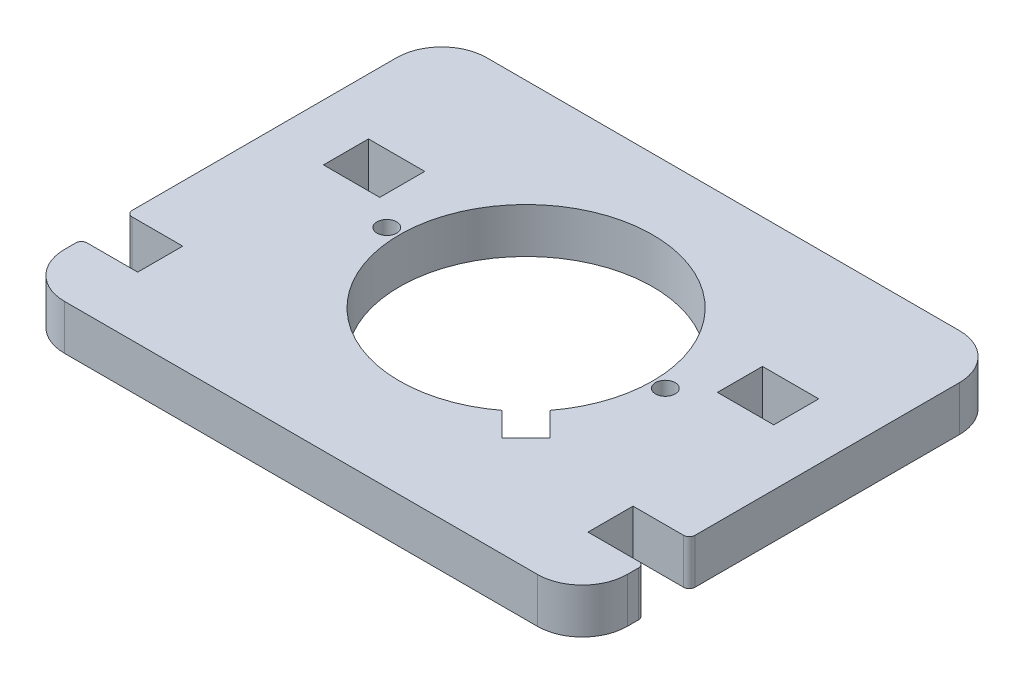
ISO-10303-21;
HEADER;
FILE_DESCRIPTION(('STEP AP214'),'2;1');
FILE_NAME('part.step','',(''),(''),'','','');
FILE_SCHEMA(('AUTOMOTIVE_DESIGN { 1 0 10303 214 1 1 1 1 }'));
ENDSEC;
DATA;
#1=APPLICATION_CONTEXT('core data for automotive mechanical design processes');
#2=APPLICATION_PROTOCOL_DEFINITION('international standard','automotive_design',2000,#1);
#3=PRODUCT_CONTEXT('',#1,'mechanical');
#4=PRODUCT('Part','Part','',(#3));
#5=PRODUCT_RELATED_PRODUCT_CATEGORY('part','',(#4));
#6=PRODUCT_DEFINITION_FORMATION('','',#4);
#7=PRODUCT_DEFINITION_CONTEXT('part definition',#1,'design');
#8=PRODUCT_DEFINITION('design','',#6,#7);
#9=PRODUCT_DEFINITION_SHAPE('','',#8);
#10=(LENGTH_UNIT() NAMED_UNIT(*) SI_UNIT(.MILLI.,.METRE.));
#11=(NAMED_UNIT(*) PLANE_ANGLE_UNIT() SI_UNIT($,.RADIAN.));
#12=(NAMED_UNIT(*) SI_UNIT($,.STERADIAN.) SOLID_ANGLE_UNIT());
#13=UNCERTAINTY_MEASURE_WITH_UNIT(LENGTH_MEASURE(1.E-05),#10,'distance_accuracy_value','');
#14=(GEOMETRIC_REPRESENTATION_CONTEXT(3) GLOBAL_UNCERTAINTY_ASSIGNED_CONTEXT((#13)) GLOBAL_UNIT_ASSIGNED_CONTEXT((#10,
#11,#12)) REPRESENTATION_CONTEXT('',''));
#15=CARTESIAN_POINT('',(0.,0.,0.));
#16=DIRECTION('',(0.,0.,1.));
#17=DIRECTION('',(1.,0.,0.));
#18=AXIS2_PLACEMENT_3D('',#15,#16,#17);
#19=CARTESIAN_POINT('',(-7.12132034355992,8.,7.12132034355984));
#20=DIRECTION('',(0.707106781186551,0.,-0.707106781186544));
#21=DIRECTION('',(-0.707106781186544,0.,-0.707106781186551));
#22=AXIS2_PLACEMENT_3D('',#19,#20,#21);
#23=PLANE('',#22);
#24=DIRECTION('',(0.707106781186544,0.,0.707106781186551));
#25=VECTOR('',#24,1.);
#26=CARTESIAN_POINT('',(-7.12132034355992,0.,7.12132034355984));
#27=LINE('',#26,#25);
#28=CARTESIAN_POINT('',(-36.3534733123383,0.,-22.1108326252188));
#29=VERTEX_POINT('',#28);
#30=CARTESIAN_POINT('',(-32.1108326252193,0.,-17.8681919380998));
#31=VERTEX_POINT('',#30);
#32=EDGE_CURVE('E363',#29,#31,#27,.T.);
#33=ORIENTED_EDGE('',*,*,#32,.F.);
#34=DIRECTION('',(0.,-1.,0.));
#35=VECTOR('',#34,1.);
#36=CARTESIAN_POINT('',(-36.3534733123383,8.,-22.1108326252188));
#37=LINE('',#36,#35);
#38=CARTESIAN_POINT('',(-36.3534733123383,8.,-22.1108326252188));
#39=VERTEX_POINT('',#38);
#40=EDGE_CURVE('E11',#39,#29,#37,.T.);
#41=ORIENTED_EDGE('',*,*,#40,.F.);
#42=DIRECTION('',(0.707106781186544,0.,0.707106781186551));
#43=VECTOR('',#42,1.);
#44=CARTESIAN_POINT('',(-7.12132034355992,8.,7.12132034355984));
#45=LINE('',#44,#43);
#46=CARTESIAN_POINT('',(-32.1108326252193,8.,-17.8681919380998));
#47=VERTEX_POINT('',#46);
#48=EDGE_CURVE('E260',#39,#47,#45,.T.);
#49=ORIENTED_EDGE('',*,*,#48,.T.);
#50=DIRECTION('',(0.,-1.,0.));
#51=VECTOR('',#50,1.);
#52=CARTESIAN_POINT('',(-32.1108326252193,8.,-17.8681919380998));
#53=LINE('',#52,#51);
#54=EDGE_CURVE('E56',#47,#31,#53,.T.);
#55=ORIENTED_EDGE('',*,*,#54,.T.);
#56=EDGE_LOOP('',(#33,#41,#49,#55));
#57=FACE_BOUND('',#56,.T.);
#58=ADVANCED_FACE('F37',(#57),#23,.T.);
#59=CARTESIAN_POINT('',(-50.,8.,-40.));
#60=DIRECTION('',(0.,-1.,0.));
#61=DIRECTION('',(0.,0.,-1.));
#62=AXIS2_PLACEMENT_3D('',#59,#60,#61);
#63=CYLINDRICAL_SURFACE('',#62,22.5);
#64=CARTESIAN_POINT('',(-50.,0.,-40.));
#65=DIRECTION('',(0.,1.,0.));
#66=DIRECTION('',(0.,0.,1.));
#67=AXIS2_PLACEMENT_3D('',#64,#65,#66);
#68=CIRCLE('',#67,22.5);
#69=CARTESIAN_POINT('',(-32.110832625219,0.,-26.3534733123381));
#70=VERTEX_POINT('',#69);
#71=EDGE_CURVE('E266',#29,#70,#68,.F.);
#72=ORIENTED_EDGE('',*,*,#71,.T.);
#73=DIRECTION('',(0.,-1.,0.));
#74=VECTOR('',#73,1.);
#75=CARTESIAN_POINT('',(-32.110832625219,8.,-26.3534733123381));
#76=LINE('',#75,#74);
#77=CARTESIAN_POINT('',(-32.110832625219,8.,-26.3534733123381));
#78=VERTEX_POINT('',#77);
#79=EDGE_CURVE('E47',#78,#70,#76,.T.);
#80=ORIENTED_EDGE('',*,*,#79,.F.);
#81=CARTESIAN_POINT('',(-50.,8.,-40.));
#82=DIRECTION('',(0.,1.,0.));
#83=DIRECTION('',(0.,0.,1.));
#84=AXIS2_PLACEMENT_3D('',#81,#82,#83);
#85=CIRCLE('',#84,22.5);
#86=EDGE_CURVE('E254',#39,#78,#85,.F.);
#87=ORIENTED_EDGE('',*,*,#86,.F.);
#88=ORIENTED_EDGE('',*,*,#40,.T.);
#89=EDGE_LOOP('',(#72,#80,#87,#88));
#90=FACE_BOUND('',#89,.T.);
#91=ADVANCED_FACE('F264',(#90),#63,.F.);
#92=CARTESIAN_POINT('',(-2.8786796564406,8.,2.87867965644057));
#93=DIRECTION('',(-0.707106781186551,0.,0.707106781186544));
#94=DIRECTION('',(0.707106781186544,0.,0.707106781186551));
#95=AXIS2_PLACEMENT_3D('',#92,#93,#94);
#96=PLANE('',#95);
#97=DIRECTION('',(-0.707106781186544,0.,-0.707106781186551));
#98=VECTOR('',#97,1.);
#99=CARTESIAN_POINT('',(-2.8786796564406,0.,2.87867965644057));
#100=LINE('',#99,#98);
#101=CARTESIAN_POINT('',(-27.8681919380997,0.,-22.1108326252188));
#102=VERTEX_POINT('',#101);
#103=EDGE_CURVE('E366',#102,#70,#100,.T.);
#104=ORIENTED_EDGE('',*,*,#103,.F.);
#105=DIRECTION('',(0.,-1.,0.));
#106=VECTOR('',#105,1.);
#107=CARTESIAN_POINT('',(-27.8681919380997,8.,-22.1108326252188));
#108=LINE('',#107,#106);
#109=CARTESIAN_POINT('',(-27.8681919380997,8.,-22.1108326252188));
#110=VERTEX_POINT('',#109);
#111=EDGE_CURVE('E153',#110,#102,#108,.T.);
#112=ORIENTED_EDGE('',*,*,#111,.F.);
#113=DIRECTION('',(-0.707106781186544,0.,-0.707106781186551));
#114=VECTOR('',#113,1.);
#115=CARTESIAN_POINT('',(-2.8786796564406,8.,2.87867965644057));
#116=LINE('',#115,#114);
#117=EDGE_CURVE('E259',#110,#78,#116,.T.);
#118=ORIENTED_EDGE('',*,*,#117,.T.);
#119=ORIENTED_EDGE('',*,*,#79,.T.);
#120=EDGE_LOOP('',(#104,#112,#118,#119));
#121=FACE_BOUND('',#120,.T.);
#122=ADVANCED_FACE('F270',(#121),#96,.T.);
#123=CARTESIAN_POINT('',(-90.,8.,0.));
#124=DIRECTION('',(1.,0.,0.));
#125=DIRECTION('',(0.,0.,-1.));
#126=AXIS2_PLACEMENT_3D('',#123,#124,#125);
#127=PLANE('',#126);
#128=DIRECTION('',(0.,0.,1.));
#129=VECTOR('',#128,1.);
#130=CARTESIAN_POINT('',(-90.,0.,0.));
#131=LINE('',#130,#129);
#132=CARTESIAN_POINT('',(-90.,0.,-52.));
#133=VERTEX_POINT('',#132);
#134=CARTESIAN_POINT('',(-90.,0.,-44.));
#135=VERTEX_POINT('',#134);
#136=EDGE_CURVE('E345',#133,#135,#131,.T.);
#137=ORIENTED_EDGE('',*,*,#136,.F.);
#138=DIRECTION('',(0.,-1.,0.));
#139=VECTOR('',#138,1.);
#140=CARTESIAN_POINT('',(-90.,8.,-52.));
#141=LINE('',#140,#139);
#142=CARTESIAN_POINT('',(-90.,8.,-52.));
#143=VERTEX_POINT('',#142);
#144=EDGE_CURVE('E373',#143,#133,#141,.T.);
#145=ORIENTED_EDGE('',*,*,#144,.F.);
#146=DIRECTION('',(0.,0.,1.));
#147=VECTOR('',#146,1.);
#148=CARTESIAN_POINT('',(-90.,8.,0.));
#149=LINE('',#148,#147);
#150=CARTESIAN_POINT('',(-90.,8.,-44.));
#151=VERTEX_POINT('',#150);
#152=EDGE_CURVE('E580',#143,#151,#149,.T.);
#153=ORIENTED_EDGE('',*,*,#152,.T.);
#154=DIRECTION('',(0.,-1.,0.));
#155=VECTOR('',#154,1.);
#156=CARTESIAN_POINT('',(-90.,8.,-44.));
#157=LINE('',#156,#155);
#158=EDGE_CURVE('E375',#151,#135,#157,.T.);
#159=ORIENTED_EDGE('',*,*,#158,.T.);
#160=EDGE_LOOP('',(#137,#145,#153,#159));
#161=FACE_BOUND('',#160,.T.);
#162=ADVANCED_FACE('F636',(#161),#127,.T.);
#163=CARTESIAN_POINT('',(0.,8.,-52.));
#164=DIRECTION('',(0.,0.,-1.));
#165=DIRECTION('',(-1.,0.,0.));
#166=AXIS2_PLACEMENT_3D('',#163,#164,#165);
#167=PLANE('',#166);
#168=DIRECTION('',(1.,0.,0.));
#169=VECTOR('',#168,1.);
#170=CARTESIAN_POINT('',(0.,0.,-52.));
#171=LINE('',#170,#169);
#172=CARTESIAN_POINT('',(-80.,0.,-52.));
#173=VERTEX_POINT('',#172);
#174=EDGE_CURVE('E348',#133,#173,#171,.T.);
#175=ORIENTED_EDGE('',*,*,#174,.T.);
#176=DIRECTION('',(0.,-1.,0.));
#177=VECTOR('',#176,1.);
#178=CARTESIAN_POINT('',(-80.,8.,-52.));
#179=LINE('',#178,#177);
#180=CARTESIAN_POINT('',(-80.,8.,-52.));
#181=VERTEX_POINT('',#180);
#182=EDGE_CURVE('E381',#181,#173,#179,.T.);
#183=ORIENTED_EDGE('',*,*,#182,.F.);
#184=DIRECTION('',(1.,0.,0.));
#185=VECTOR('',#184,1.);
#186=CARTESIAN_POINT('',(0.,8.,-52.));
#187=LINE('',#186,#185);
#188=EDGE_CURVE('E583',#143,#181,#187,.T.);
#189=ORIENTED_EDGE('',*,*,#188,.F.);
#190=ORIENTED_EDGE('',*,*,#144,.T.);
#191=EDGE_LOOP('',(#175,#183,#189,#190));
#192=FACE_BOUND('',#191,.T.);
#193=ADVANCED_FACE('F632',(#192),#167,.F.);
#194=CARTESIAN_POINT('',(-80.,8.,0.));
#195=DIRECTION('',(1.,0.,0.));
#196=DIRECTION('',(0.,0.,-1.));
#197=AXIS2_PLACEMENT_3D('',#194,#195,#196);
#198=PLANE('',#197);
#199=DIRECTION('',(0.,0.,1.));
#200=VECTOR('',#199,1.);
#201=CARTESIAN_POINT('',(-80.,0.,0.));
#202=LINE('',#201,#200);
#203=CARTESIAN_POINT('',(-80.,0.,-44.));
#204=VERTEX_POINT('',#203);
#205=EDGE_CURVE('E351',#173,#204,#202,.T.);
#206=ORIENTED_EDGE('',*,*,#205,.T.);
#207=DIRECTION('',(0.,-1.,0.));
#208=VECTOR('',#207,1.);
#209=CARTESIAN_POINT('',(-80.,8.,-44.));
#210=LINE('',#209,#208);
#211=CARTESIAN_POINT('',(-80.,8.,-44.));
#212=VERTEX_POINT('',#211);
#213=EDGE_CURVE('E377',#212,#204,#210,.T.);
#214=ORIENTED_EDGE('',*,*,#213,.F.);
#215=DIRECTION('',(0.,0.,1.));
#216=VECTOR('',#215,1.);
#217=CARTESIAN_POINT('',(-80.,8.,0.));
#218=LINE('',#217,#216);
#219=EDGE_CURVE('E586',#181,#212,#218,.T.);
#220=ORIENTED_EDGE('',*,*,#219,.F.);
#221=ORIENTED_EDGE('',*,*,#182,.T.);
#222=EDGE_LOOP('',(#206,#214,#220,#221));
#223=FACE_BOUND('',#222,.T.);
#224=ADVANCED_FACE('F628',(#223),#198,.F.);
#225=CARTESIAN_POINT('',(0.,8.,-52.));
#226=DIRECTION('',(0.,0.,1.));
#227=DIRECTION('',(1.,0.,0.));
#228=AXIS2_PLACEMENT_3D('',#225,#226,#227);
#229=PLANE('',#228);
#230=DIRECTION('',(-1.,0.,0.));
#231=VECTOR('',#230,1.);
#232=CARTESIAN_POINT('',(0.,0.,-52.));
#233=LINE('',#232,#231);
#234=CARTESIAN_POINT('',(-10.,0.,-52.));
#235=VERTEX_POINT('',#234);
#236=CARTESIAN_POINT('',(-20.,0.,-52.));
#237=VERTEX_POINT('',#236);
#238=EDGE_CURVE('E333',#235,#237,#233,.T.);
#239=ORIENTED_EDGE('',*,*,#238,.F.);
#240=DIRECTION('',(0.,-1.,0.));
#241=VECTOR('',#240,1.);
#242=CARTESIAN_POINT('',(-10.,8.,-52.));
#243=LINE('',#242,#241);
#244=CARTESIAN_POINT('',(-10.,8.,-52.));
#245=VERTEX_POINT('',#244);
#246=EDGE_CURVE('E378',#245,#235,#243,.T.);
#247=ORIENTED_EDGE('',*,*,#246,.F.);
#248=DIRECTION('',(-1.,0.,0.));
#249=VECTOR('',#248,1.);
#250=CARTESIAN_POINT('',(0.,8.,-52.));
#251=LINE('',#250,#249);
#252=CARTESIAN_POINT('',(-20.,8.,-52.));
#253=VERTEX_POINT('',#252);
#254=EDGE_CURVE('E569',#245,#253,#251,.T.);
#255=ORIENTED_EDGE('',*,*,#254,.T.);
#256=DIRECTION('',(0.,-1.,0.));
#257=VECTOR('',#256,1.);
#258=CARTESIAN_POINT('',(-20.,8.,-52.));
#259=LINE('',#258,#257);
#260=EDGE_CURVE('E385',#253,#237,#259,.T.);
#261=ORIENTED_EDGE('',*,*,#260,.T.);
#262=EDGE_LOOP('',(#239,#247,#255,#261));
#263=FACE_BOUND('',#262,.T.);
#264=ADVANCED_FACE('F631',(#263),#229,.T.);
#265=CARTESIAN_POINT('',(-9.99999999999999,8.,0.));
#266=DIRECTION('',(1.,0.,0.));
#267=DIRECTION('',(0.,0.,-1.));
#268=AXIS2_PLACEMENT_3D('',#265,#266,#267);
#269=PLANE('',#268);
#270=DIRECTION('',(0.,0.,1.));
#271=VECTOR('',#270,1.);
#272=CARTESIAN_POINT('',(-9.99999999999999,0.,0.));
#273=LINE('',#272,#271);
#274=CARTESIAN_POINT('',(-10.,0.,-44.));
#275=VERTEX_POINT('',#274);
#276=EDGE_CURVE('E336',#235,#275,#273,.T.);
#277=ORIENTED_EDGE('',*,*,#276,.T.);
#278=DIRECTION('',(0.,-1.,0.));
#279=VECTOR('',#278,1.);
#280=CARTESIAN_POINT('',(-10.,8.,-44.));
#281=LINE('',#280,#279);
#282=CARTESIAN_POINT('',(-10.,8.,-44.));
#283=VERTEX_POINT('',#282);
#284=EDGE_CURVE('E389',#283,#275,#281,.T.);
#285=ORIENTED_EDGE('',*,*,#284,.F.);
#286=DIRECTION('',(0.,0.,1.));
#287=VECTOR('',#286,1.);
#288=CARTESIAN_POINT('',(-9.99999999999999,8.,0.));
#289=LINE('',#288,#287);
#290=EDGE_CURVE('E572',#245,#283,#289,.T.);
#291=ORIENTED_EDGE('',*,*,#290,.F.);
#292=ORIENTED_EDGE('',*,*,#246,.T.);
#293=EDGE_LOOP('',(#277,#285,#291,#292));
#294=FACE_BOUND('',#293,.T.);
#295=ADVANCED_FACE('F647',(#294),#269,.F.);
#296=CARTESIAN_POINT('',(0.,8.,-44.));
#297=DIRECTION('',(0.,0.,-1.));
#298=DIRECTION('',(-1.,0.,0.));
#299=AXIS2_PLACEMENT_3D('',#296,#297,#298);
#300=PLANE('',#299);
#301=DIRECTION('',(1.,0.,0.));
#302=VECTOR('',#301,1.);
#303=CARTESIAN_POINT('',(0.,0.,-44.));
#304=LINE('',#303,#302);
#305=CARTESIAN_POINT('',(-20.,0.,-44.));
#306=VERTEX_POINT('',#305);
#307=EDGE_CURVE('E339',#306,#275,#304,.T.);
#308=ORIENTED_EDGE('',*,*,#307,.F.);
#309=DIRECTION('',(0.,-1.,0.));
#310=VECTOR('',#309,1.);
#311=CARTESIAN_POINT('',(-20.,8.,-44.));
#312=LINE('',#311,#310);
#313=CARTESIAN_POINT('',(-20.,8.,-44.));
#314=VERTEX_POINT('',#313);
#315=EDGE_CURVE('E387',#314,#306,#312,.T.);
#316=ORIENTED_EDGE('',*,*,#315,.F.);
#317=DIRECTION('',(1.,0.,0.));
#318=VECTOR('',#317,1.);
#319=CARTESIAN_POINT('',(0.,8.,-44.));
#320=LINE('',#319,#318);
#321=EDGE_CURVE('E574',#314,#283,#320,.T.);
#322=ORIENTED_EDGE('',*,*,#321,.T.);
#323=ORIENTED_EDGE('',*,*,#284,.T.);
#324=EDGE_LOOP('',(#308,#316,#322,#323));
#325=FACE_BOUND('',#324,.T.);
#326=ADVANCED_FACE('F644',(#325),#300,.T.);
#327=CARTESIAN_POINT('',(0.,8.,0.));
#328=DIRECTION('',(1.,0.,0.));
#329=DIRECTION('',(0.,0.,-1.));
#330=AXIS2_PLACEMENT_3D('',#327,#328,#329);
#331=PLANE('',#330);
#332=DIRECTION('',(0.,0.,1.));
#333=VECTOR('',#332,1.);
#334=CARTESIAN_POINT('',(0.,0.,0.));
#335=LINE('',#334,#333);
#336=CARTESIAN_POINT('',(0.,0.,-67.));
#337=VERTEX_POINT('',#336);
#338=CARTESIAN_POINT('',(0.,0.,-20.));
#339=VERTEX_POINT('',#338);
#340=EDGE_CURVE('E277',#337,#339,#335,.T.);
#341=ORIENTED_EDGE('',*,*,#340,.F.);
#342=DIRECTION('',(0.,-1.,0.));
#343=VECTOR('',#342,1.);
#344=CARTESIAN_POINT('',(0.,8.,-67.));
#345=LINE('',#344,#343);
#346=CARTESIAN_POINT('',(0.,8.,-67.));
#347=VERTEX_POINT('',#346);
#348=EDGE_CURVE('E41',#347,#337,#345,.T.);
#349=ORIENTED_EDGE('',*,*,#348,.F.);
#350=DIRECTION('',(0.,0.,1.));
#351=VECTOR('',#350,1.);
#352=CARTESIAN_POINT('',(0.,8.,0.));
#353=LINE('',#352,#351);
#354=CARTESIAN_POINT('',(0.,8.,-20.));
#355=VERTEX_POINT('',#354);
#356=EDGE_CURVE('E371',#347,#355,#353,.T.);
#357=ORIENTED_EDGE('',*,*,#356,.T.);
#358=DIRECTION('',(0.,-1.,0.));
#359=VECTOR('',#358,1.);
#360=CARTESIAN_POINT('',(0.,8.,-20.));
#361=LINE('',#360,#359);
#362=EDGE_CURVE('E273',#355,#339,#361,.T.);
#363=ORIENTED_EDGE('',*,*,#362,.T.);
#364=EDGE_LOOP('',(#341,#349,#357,#363));
#365=FACE_BOUND('',#364,.T.);
#366=ADVANCED_FACE('F39',(#365),#331,.T.);
#367=CARTESIAN_POINT('',(-7.99999999999999,8.,-67.));
#368=DIRECTION('',(0.,-1.,0.));
#369=DIRECTION('',(0.,0.,-1.));
#370=AXIS2_PLACEMENT_3D('',#367,#368,#369);
#371=CYLINDRICAL_SURFACE('',#370,7.99999999999999);
#372=CARTESIAN_POINT('',(-7.99999999999999,0.,-67.));
#373=DIRECTION('',(0.,1.,0.));
#374=DIRECTION('',(0.,0.,1.));
#375=AXIS2_PLACEMENT_3D('',#372,#373,#374);
#376=CIRCLE('',#375,7.99999999999999);
#377=CARTESIAN_POINT('',(-7.99999999999999,0.,-75.));
#378=VERTEX_POINT('',#377);
#379=EDGE_CURVE('E280',#337,#378,#376,.T.);
#380=ORIENTED_EDGE('',*,*,#379,.T.);
#381=DIRECTION('',(0.,-1.,0.));
#382=VECTOR('',#381,1.);
#383=CARTESIAN_POINT('',(-7.99999999999999,8.,-75.));
#384=LINE('',#383,#382);
#385=CARTESIAN_POINT('',(-7.99999999999999,8.,-75.));
#386=VERTEX_POINT('',#385);
#387=EDGE_CURVE('E430',#386,#378,#384,.T.);
#388=ORIENTED_EDGE('',*,*,#387,.F.);
#389=CARTESIAN_POINT('',(-7.99999999999999,8.,-67.));
#390=DIRECTION('',(0.,1.,0.));
#391=DIRECTION('',(0.,0.,1.));
#392=AXIS2_PLACEMENT_3D('',#389,#390,#391);
#393=CIRCLE('',#392,7.99999999999999);
#394=EDGE_CURVE('E438',#347,#386,#393,.T.);
#395=ORIENTED_EDGE('',*,*,#394,.F.);
#396=ORIENTED_EDGE('',*,*,#348,.T.);
#397=EDGE_LOOP('',(#380,#388,#395,#396));
#398=FACE_BOUND('',#397,.T.);
#399=ADVANCED_FACE('F437',(#398),#371,.T.);
#400=CARTESIAN_POINT('',(0.,8.,-75.));
#401=DIRECTION('',(0.,0.,-1.));
#402=DIRECTION('',(-1.,0.,0.));
#403=AXIS2_PLACEMENT_3D('',#400,#401,#402);
#404=PLANE('',#403);
#405=DIRECTION('',(1.,0.,0.));
#406=VECTOR('',#405,1.);
#407=CARTESIAN_POINT('',(0.,0.,-75.));
#408=LINE('',#407,#406);
#409=CARTESIAN_POINT('',(-92.,0.,-75.));
#410=VERTEX_POINT('',#409);
#411=EDGE_CURVE('E283',#410,#378,#408,.T.);
#412=ORIENTED_EDGE('',*,*,#411,.F.);
#413=DIRECTION('',(0.,-1.,0.));
#414=VECTOR('',#413,1.);
#415=CARTESIAN_POINT('',(-92.,8.,-75.));
#416=LINE('',#415,#414);
#417=CARTESIAN_POINT('',(-92.,8.,-75.));
#418=VERTEX_POINT('',#417);
#419=EDGE_CURVE('E429',#418,#410,#416,.T.);
#420=ORIENTED_EDGE('',*,*,#419,.F.);
#421=DIRECTION('',(1.,0.,0.));
#422=VECTOR('',#421,1.);
#423=CARTESIAN_POINT('',(0.,8.,-75.));
#424=LINE('',#423,#422);
#425=EDGE_CURVE('E537',#418,#386,#424,.T.);
#426=ORIENTED_EDGE('',*,*,#425,.T.);
#427=ORIENTED_EDGE('',*,*,#387,.T.);
#428=EDGE_LOOP('',(#412,#420,#426,#427));
#429=FACE_BOUND('',#428,.T.);
#430=ADVANCED_FACE('F534',(#429),#404,.T.);
#431=CARTESIAN_POINT('',(-92.,8.,-67.));
#432=DIRECTION('',(0.,-1.,0.));
#433=DIRECTION('',(0.,0.,-1.));
#434=AXIS2_PLACEMENT_3D('',#431,#432,#433);
#435=CYLINDRICAL_SURFACE('',#434,8.);
#436=CARTESIAN_POINT('',(-92.,0.,-67.));
#437=DIRECTION('',(0.,1.,0.));
#438=DIRECTION('',(0.,0.,1.));
#439=AXIS2_PLACEMENT_3D('',#436,#437,#438);
#440=CIRCLE('',#439,8.);
#441=CARTESIAN_POINT('',(-100.,0.,-67.));
#442=VERTEX_POINT('',#441);
#443=EDGE_CURVE('E286',#410,#442,#440,.T.);
#444=ORIENTED_EDGE('',*,*,#443,.T.);
#445=DIRECTION('',(0.,-1.,0.));
#446=VECTOR('',#445,1.);
#447=CARTESIAN_POINT('',(-100.,8.,-67.));
#448=LINE('',#447,#446);
#449=CARTESIAN_POINT('',(-100.,8.,-67.));
#450=VERTEX_POINT('',#449);
#451=EDGE_CURVE('E427',#450,#442,#448,.T.);
#452=ORIENTED_EDGE('',*,*,#451,.F.);
#453=CARTESIAN_POINT('',(-92.,8.,-67.));
#454=DIRECTION('',(0.,1.,0.));
#455=DIRECTION('',(0.,0.,1.));
#456=AXIS2_PLACEMENT_3D('',#453,#454,#455);
#457=CIRCLE('',#456,8.);
#458=EDGE_CURVE('E538',#418,#450,#457,.T.);
#459=ORIENTED_EDGE('',*,*,#458,.F.);
#460=ORIENTED_EDGE('',*,*,#419,.T.);
#461=EDGE_LOOP('',(#444,#452,#459,#460));
#462=FACE_BOUND('',#461,.T.);
#463=ADVANCED_FACE('F539',(#462),#435,.T.);
#464=CARTESIAN_POINT('',(-99.9999999999999,8.,0.));
#465=DIRECTION('',(-1.,0.,0.));
#466=DIRECTION('',(0.,0.,1.));
#467=AXIS2_PLACEMENT_3D('',#464,#465,#466);
#468=PLANE('',#467);
#469=DIRECTION('',(0.,0.,-1.));
#470=VECTOR('',#469,1.);
#471=CARTESIAN_POINT('',(-99.9999999999999,0.,0.));
#472=LINE('',#471,#470);
#473=CARTESIAN_POINT('',(-100.,0.,-20.));
#474=VERTEX_POINT('',#473);
#475=EDGE_CURVE('E289',#474,#442,#472,.T.);
#476=ORIENTED_EDGE('',*,*,#475,.F.);
#477=DIRECTION('',(0.,-1.,0.));
#478=VECTOR('',#477,1.);
#479=CARTESIAN_POINT('',(-100.,8.,-20.));
#480=LINE('',#479,#478);
#481=CARTESIAN_POINT('',(-100.,8.,-20.));
#482=VERTEX_POINT('',#481);
#483=EDGE_CURVE('E425',#482,#474,#480,.T.);
#484=ORIENTED_EDGE('',*,*,#483,.F.);
#485=DIRECTION('',(0.,0.,-1.));
#486=VECTOR('',#485,1.);
#487=CARTESIAN_POINT('',(-99.9999999999999,8.,0.));
#488=LINE('',#487,#486);
#489=EDGE_CURVE('E531',#482,#450,#488,.T.);
#490=ORIENTED_EDGE('',*,*,#489,.T.);
#491=ORIENTED_EDGE('',*,*,#451,.T.);
#492=EDGE_LOOP('',(#476,#484,#490,#491));
#493=FACE_BOUND('',#492,.T.);
#494=ADVANCED_FACE('F530',(#493),#468,.T.);
#495=CARTESIAN_POINT('',(-99.,8.,-20.));
#496=DIRECTION('',(0.,-1.,0.));
#497=DIRECTION('',(0.,0.,-1.));
#498=AXIS2_PLACEMENT_3D('',#495,#496,#497);
#499=CYLINDRICAL_SURFACE('',#498,1.);
#500=CARTESIAN_POINT('',(-99.,0.,-20.));
#501=DIRECTION('',(0.,1.,0.));
#502=DIRECTION('',(0.,0.,1.));
#503=AXIS2_PLACEMENT_3D('',#500,#501,#502);
#504=CIRCLE('',#503,1.);
#505=CARTESIAN_POINT('',(-99.,0.,-19.));
#506=VERTEX_POINT('',#505);
#507=EDGE_CURVE('E292',#474,#506,#504,.T.);
#508=ORIENTED_EDGE('',*,*,#507,.T.);
#509=DIRECTION('',(0.,-1.,0.));
#510=VECTOR('',#509,1.);
#511=CARTESIAN_POINT('',(-99.,8.,-19.));
#512=LINE('',#511,#510);
#513=CARTESIAN_POINT('',(-99.,8.,-19.));
#514=VERTEX_POINT('',#513);
#515=EDGE_CURVE('E422',#514,#506,#512,.T.);
#516=ORIENTED_EDGE('',*,*,#515,.F.);
#517=CARTESIAN_POINT('',(-99.,8.,-20.));
#518=DIRECTION('',(0.,1.,0.));
#519=DIRECTION('',(0.,0.,1.));
#520=AXIS2_PLACEMENT_3D('',#517,#518,#519);
#521=CIRCLE('',#520,1.);
#522=EDGE_CURVE('E526',#482,#514,#521,.T.);
#523=ORIENTED_EDGE('',*,*,#522,.F.);
#524=ORIENTED_EDGE('',*,*,#483,.T.);
#525=EDGE_LOOP('',(#508,#516,#523,#524));
#526=FACE_BOUND('',#525,.T.);
#527=ADVANCED_FACE('F525',(#526),#499,.T.);
#528=CARTESIAN_POINT('',(0.,8.,-19.));
#529=DIRECTION('',(0.,0.,-1.));
#530=DIRECTION('',(-1.,0.,0.));
#531=AXIS2_PLACEMENT_3D('',#528,#529,#530);
#532=PLANE('',#531);
#533=DIRECTION('',(1.,0.,0.));
#534=VECTOR('',#533,1.);
#535=CARTESIAN_POINT('',(0.,0.,-19.));
#536=LINE('',#535,#534);
#537=CARTESIAN_POINT('',(-90.,0.,-19.));
#538=VERTEX_POINT('',#537);
#539=EDGE_CURVE('E294',#506,#538,#536,.T.);
#540=ORIENTED_EDGE('',*,*,#539,.T.);
#541=DIRECTION('',(0.,-1.,0.));
#542=VECTOR('',#541,1.);
#543=CARTESIAN_POINT('',(-90.,8.,-19.));
#544=LINE('',#543,#542);
#545=CARTESIAN_POINT('',(-90.,8.,-19.));
#546=VERTEX_POINT('',#545);
#547=EDGE_CURVE('E419',#546,#538,#544,.T.);
#548=ORIENTED_EDGE('',*,*,#547,.F.);
#549=DIRECTION('',(1.,0.,0.));
#550=VECTOR('',#549,1.);
#551=CARTESIAN_POINT('',(0.,8.,-19.));
#552=LINE('',#551,#550);
#553=EDGE_CURVE('E522',#514,#546,#552,.T.);
#554=ORIENTED_EDGE('',*,*,#553,.F.);
#555=ORIENTED_EDGE('',*,*,#515,.T.);
#556=EDGE_LOOP('',(#540,#548,#554,#555));
#557=FACE_BOUND('',#556,.T.);
#558=ADVANCED_FACE('F519',(#557),#532,.F.);
#559=CARTESIAN_POINT('',(-90.,8.,0.));
#560=DIRECTION('',(1.,0.,0.));
#561=DIRECTION('',(0.,0.,-1.));
#562=AXIS2_PLACEMENT_3D('',#559,#560,#561);
#563=PLANE('',#562);
#564=DIRECTION('',(0.,0.,1.));
#565=VECTOR('',#564,1.);
#566=CARTESIAN_POINT('',(-90.,0.,0.));
#567=LINE('',#566,#565);
#568=CARTESIAN_POINT('',(-90.,0.,-11.));
#569=VERTEX_POINT('',#568);
#570=EDGE_CURVE('E296',#538,#569,#567,.T.);
#571=ORIENTED_EDGE('',*,*,#570,.T.);
#572=DIRECTION('',(0.,-1.,0.));
#573=VECTOR('',#572,1.);
#574=CARTESIAN_POINT('',(-90.,8.,-11.));
#575=LINE('',#574,#573);
#576=CARTESIAN_POINT('',(-90.,8.,-11.));
#577=VERTEX_POINT('',#576);
#578=EDGE_CURVE('E416',#577,#569,#575,.T.);
#579=ORIENTED_EDGE('',*,*,#578,.F.);
#580=DIRECTION('',(0.,0.,1.));
#581=VECTOR('',#580,1.);
#582=CARTESIAN_POINT('',(-90.,8.,0.));
#583=LINE('',#582,#581);
#584=EDGE_CURVE('E513',#546,#577,#583,.T.);
#585=ORIENTED_EDGE('',*,*,#584,.F.);
#586=ORIENTED_EDGE('',*,*,#547,.T.);
#587=EDGE_LOOP('',(#571,#579,#585,#586));
#588=FACE_BOUND('',#587,.T.);
#589=ADVANCED_FACE('F512',(#588),#563,.F.);
#590=CARTESIAN_POINT('',(0.,8.,-11.));
#591=DIRECTION('',(0.,0.,1.));
#592=DIRECTION('',(1.,0.,0.));
#593=AXIS2_PLACEMENT_3D('',#590,#591,#592);
#594=PLANE('',#593);
#595=DIRECTION('',(-1.,0.,0.));
#596=VECTOR('',#595,1.);
#597=CARTESIAN_POINT('',(0.,0.,-11.));
#598=LINE('',#597,#596);
#599=CARTESIAN_POINT('',(-99.,0.,-11.));
#600=VERTEX_POINT('',#599);
#601=EDGE_CURVE('E298',#569,#600,#598,.T.);
#602=ORIENTED_EDGE('',*,*,#601,.T.);
#603=DIRECTION('',(0.,-1.,0.));
#604=VECTOR('',#603,1.);
#605=CARTESIAN_POINT('',(-99.,8.,-11.));
#606=LINE('',#605,#604);
#607=CARTESIAN_POINT('',(-99.,8.,-11.));
#608=VERTEX_POINT('',#607);
#609=EDGE_CURVE('E414',#608,#600,#606,.T.);
#610=ORIENTED_EDGE('',*,*,#609,.F.);
#611=DIRECTION('',(-1.,0.,0.));
#612=VECTOR('',#611,1.);
#613=CARTESIAN_POINT('',(0.,8.,-11.));
#614=LINE('',#613,#612);
#615=EDGE_CURVE('E509',#577,#608,#614,.T.);
#616=ORIENTED_EDGE('',*,*,#615,.F.);
#617=ORIENTED_EDGE('',*,*,#578,.T.);
#618=EDGE_LOOP('',(#602,#610,#616,#617));
#619=FACE_BOUND('',#618,.T.);
#620=ADVANCED_FACE('F507',(#619),#594,.F.);
#621=CARTESIAN_POINT('',(-99.,8.,-10.));
#622=DIRECTION('',(0.,-1.,0.));
#623=DIRECTION('',(0.,0.,-1.));
#624=AXIS2_PLACEMENT_3D('',#621,#622,#623);
#625=CYLINDRICAL_SURFACE('',#624,1.);
#626=CARTESIAN_POINT('',(-99.,0.,-10.));
#627=DIRECTION('',(0.,1.,0.));
#628=DIRECTION('',(0.,0.,1.));
#629=AXIS2_PLACEMENT_3D('',#626,#627,#628);
#630=CIRCLE('',#629,1.);
#631=CARTESIAN_POINT('',(-100.,0.,-9.99999999999999));
#632=VERTEX_POINT('',#631);
#633=EDGE_CURVE('E301',#632,#600,#630,.F.);
#634=ORIENTED_EDGE('',*,*,#633,.F.);
#635=DIRECTION('',(0.,-1.,0.));
#636=VECTOR('',#635,1.);
#637=CARTESIAN_POINT('',(-100.,8.,-9.99999999999999));
#638=LINE('',#637,#636);
#639=CARTESIAN_POINT('',(-100.,8.,-9.99999999999999));
#640=VERTEX_POINT('',#639);
#641=EDGE_CURVE('E412',#640,#632,#638,.T.);
#642=ORIENTED_EDGE('',*,*,#641,.F.);
#643=CARTESIAN_POINT('',(-99.,8.,-10.));
#644=DIRECTION('',(0.,1.,0.));
#645=DIRECTION('',(0.,0.,1.));
#646=AXIS2_PLACEMENT_3D('',#643,#644,#645);
#647=CIRCLE('',#646,1.);
#648=EDGE_CURVE('E504',#640,#608,#647,.F.);
#649=ORIENTED_EDGE('',*,*,#648,.T.);
#650=ORIENTED_EDGE('',*,*,#609,.T.);
#651=EDGE_LOOP('',(#634,#642,#649,#650));
#652=FACE_BOUND('',#651,.T.);
#653=ADVANCED_FACE('F500',(#652),#625,.T.);
#654=CARTESIAN_POINT('',(-100.,8.,-6.93889390390722E-13));
#655=DIRECTION('',(-1.,0.,0.));
#656=DIRECTION('',(0.,0.,1.));
#657=AXIS2_PLACEMENT_3D('',#654,#655,#656);
#658=PLANE('',#657);
#659=DIRECTION('',(0.,0.,-1.));
#660=VECTOR('',#659,1.);
#661=CARTESIAN_POINT('',(-100.,0.,-6.93889390390722E-13));
#662=LINE('',#661,#660);
#663=CARTESIAN_POINT('',(-100.,0.,-7.99999999999999));
#664=VERTEX_POINT('',#663);
#665=EDGE_CURVE('E304',#664,#632,#662,.T.);
#666=ORIENTED_EDGE('',*,*,#665,.F.);
#667=DIRECTION('',(0.,-1.,0.));
#668=VECTOR('',#667,1.);
#669=CARTESIAN_POINT('',(-100.,8.,-7.99999999999999));
#670=LINE('',#669,#668);
#671=CARTESIAN_POINT('',(-100.,8.,-7.99999999999999));
#672=VERTEX_POINT('',#671);
#673=EDGE_CURVE('E410',#672,#664,#670,.T.);
#674=ORIENTED_EDGE('',*,*,#673,.F.);
#675=DIRECTION('',(0.,0.,-1.));
#676=VECTOR('',#675,1.);
#677=CARTESIAN_POINT('',(-100.,8.,-6.93889390390722E-13));
#678=LINE('',#677,#676);
#679=EDGE_CURVE('E553',#672,#640,#678,.T.);
#680=ORIENTED_EDGE('',*,*,#679,.T.);
#681=ORIENTED_EDGE('',*,*,#641,.T.);
#682=EDGE_LOOP('',(#666,#674,#680,#681));
#683=FACE_BOUND('',#682,.T.);
#684=ADVANCED_FACE('F495',(#683),#658,.T.);
#685=CARTESIAN_POINT('',(-92.,8.,-7.99999999999999));
#686=DIRECTION('',(0.,-1.,0.));
#687=DIRECTION('',(0.,0.,-1.));
#688=AXIS2_PLACEMENT_3D('',#685,#686,#687);
#689=CYLINDRICAL_SURFACE('',#688,8.);
#690=CARTESIAN_POINT('',(-92.,0.,-7.99999999999999));
#691=DIRECTION('',(0.,1.,0.));
#692=DIRECTION('',(0.,0.,1.));
#693=AXIS2_PLACEMENT_3D('',#690,#691,#692);
#694=CIRCLE('',#693,8.);
#695=CARTESIAN_POINT('',(-92.,0.,0.));
#696=VERTEX_POINT('',#695);
#697=EDGE_CURVE('E307',#696,#664,#694,.F.);
#698=ORIENTED_EDGE('',*,*,#697,.F.);
#699=DIRECTION('',(0.,-1.,0.));
#700=VECTOR('',#699,1.);
#701=CARTESIAN_POINT('',(-92.,8.,0.));
#702=LINE('',#701,#700);
#703=CARTESIAN_POINT('',(-92.,8.,0.));
#704=VERTEX_POINT('',#703);
#705=EDGE_CURVE('E408',#704,#696,#702,.T.);
#706=ORIENTED_EDGE('',*,*,#705,.F.);
#707=CARTESIAN_POINT('',(-92.,8.,-7.99999999999999));
#708=DIRECTION('',(0.,1.,0.));
#709=DIRECTION('',(0.,0.,1.));
#710=AXIS2_PLACEMENT_3D('',#707,#708,#709);
#711=CIRCLE('',#710,8.);
#712=EDGE_CURVE('E491',#704,#672,#711,.F.);
#713=ORIENTED_EDGE('',*,*,#712,.T.);
#714=ORIENTED_EDGE('',*,*,#673,.T.);
#715=EDGE_LOOP('',(#698,#706,#713,#714));
#716=FACE_BOUND('',#715,.T.);
#717=ADVANCED_FACE('F489',(#716),#689,.T.);
#718=CARTESIAN_POINT('',(0.,8.,0.));
#719=DIRECTION('',(0.,0.,1.));
#720=DIRECTION('',(1.,0.,0.));
#721=AXIS2_PLACEMENT_3D('',#718,#719,#720);
#722=PLANE('',#721);
#723=DIRECTION('',(-1.,0.,0.));
#724=VECTOR('',#723,1.);
#725=CARTESIAN_POINT('',(0.,0.,0.));
#726=LINE('',#725,#724);
#727=CARTESIAN_POINT('',(-7.99999999999999,0.,0.));
#728=VERTEX_POINT('',#727);
#729=EDGE_CURVE('E310',#728,#696,#726,.T.);
#730=ORIENTED_EDGE('',*,*,#729,.F.);
#731=DIRECTION('',(0.,-1.,0.));
#732=VECTOR('',#731,1.);
#733=CARTESIAN_POINT('',(-7.99999999999999,8.,0.));
#734=LINE('',#733,#732);
#735=CARTESIAN_POINT('',(-7.99999999999999,8.,0.));
#736=VERTEX_POINT('',#735);
#737=EDGE_CURVE('E406',#736,#728,#734,.T.);
#738=ORIENTED_EDGE('',*,*,#737,.F.);
#739=DIRECTION('',(-1.,0.,0.));
#740=VECTOR('',#739,1.);
#741=CARTESIAN_POINT('',(0.,8.,0.));
#742=LINE('',#741,#740);
#743=EDGE_CURVE('E485',#736,#704,#742,.T.);
#744=ORIENTED_EDGE('',*,*,#743,.T.);
#745=ORIENTED_EDGE('',*,*,#705,.T.);
#746=EDGE_LOOP('',(#730,#738,#744,#745));
#747=FACE_BOUND('',#746,.T.);
#748=ADVANCED_FACE('F482',(#747),#722,.T.);
#749=CARTESIAN_POINT('',(-7.99999999999999,8.,-8.));
#750=DIRECTION('',(0.,-1.,0.));
#751=DIRECTION('',(0.,0.,-1.));
#752=AXIS2_PLACEMENT_3D('',#749,#750,#751);
#753=CYLINDRICAL_SURFACE('',#752,8.);
#754=CARTESIAN_POINT('',(-7.99999999999999,0.,-8.));
#755=DIRECTION('',(0.,1.,0.));
#756=DIRECTION('',(0.,0.,1.));
#757=AXIS2_PLACEMENT_3D('',#754,#755,#756);
#758=CIRCLE('',#757,8.);
#759=CARTESIAN_POINT('',(0.,0.,-8.));
#760=VERTEX_POINT('',#759);
#761=EDGE_CURVE('E313',#760,#728,#758,.F.);
#762=ORIENTED_EDGE('',*,*,#761,.F.);
#763=DIRECTION('',(0.,-1.,0.));
#764=VECTOR('',#763,1.);
#765=CARTESIAN_POINT('',(0.,8.,-8.));
#766=LINE('',#765,#764);
#767=CARTESIAN_POINT('',(0.,8.,-8.));
#768=VERTEX_POINT('',#767);
#769=EDGE_CURVE('E404',#768,#760,#766,.T.);
#770=ORIENTED_EDGE('',*,*,#769,.F.);
#771=CARTESIAN_POINT('',(-7.99999999999999,8.,-8.));
#772=DIRECTION('',(0.,1.,0.));
#773=DIRECTION('',(0.,0.,1.));
#774=AXIS2_PLACEMENT_3D('',#771,#772,#773);
#775=CIRCLE('',#774,8.);
#776=EDGE_CURVE('E557',#768,#736,#775,.F.);
#777=ORIENTED_EDGE('',*,*,#776,.T.);
#778=ORIENTED_EDGE('',*,*,#737,.T.);
#779=EDGE_LOOP('',(#762,#770,#777,#778));
#780=FACE_BOUND('',#779,.T.);
#781=ADVANCED_FACE('F478',(#780),#753,.T.);
#782=CARTESIAN_POINT('',(0.,8.,0.));
#783=DIRECTION('',(1.,0.,0.));
#784=DIRECTION('',(0.,0.,-1.));
#785=AXIS2_PLACEMENT_3D('',#782,#783,#784);
#786=PLANE('',#785);
#787=DIRECTION('',(0.,0.,1.));
#788=VECTOR('',#787,1.);
#789=CARTESIAN_POINT('',(0.,0.,0.));
#790=LINE('',#789,#788);
#791=CARTESIAN_POINT('',(0.,0.,-9.99999999999999));
#792=VERTEX_POINT('',#791);
#793=EDGE_CURVE('E316',#792,#760,#790,.T.);
#794=ORIENTED_EDGE('',*,*,#793,.F.);
#795=DIRECTION('',(0.,-1.,0.));
#796=VECTOR('',#795,1.);
#797=CARTESIAN_POINT('',(0.,8.,-9.99999999999999));
#798=LINE('',#797,#796);
#799=CARTESIAN_POINT('',(0.,8.,-9.99999999999999));
#800=VERTEX_POINT('',#799);
#801=EDGE_CURVE('E402',#800,#792,#798,.T.);
#802=ORIENTED_EDGE('',*,*,#801,.F.);
#803=DIRECTION('',(0.,0.,1.));
#804=VECTOR('',#803,1.);
#805=CARTESIAN_POINT('',(0.,8.,0.));
#806=LINE('',#805,#804);
#807=EDGE_CURVE('E474',#800,#768,#806,.T.);
#808=ORIENTED_EDGE('',*,*,#807,.T.);
#809=ORIENTED_EDGE('',*,*,#769,.T.);
#810=EDGE_LOOP('',(#794,#802,#808,#809));
#811=FACE_BOUND('',#810,.T.);
#812=ADVANCED_FACE('F469',(#811),#786,.T.);
#813=CARTESIAN_POINT('',(-0.999999999999993,8.,-10.));
#814=DIRECTION('',(0.,-1.,0.));
#815=DIRECTION('',(0.,0.,-1.));
#816=AXIS2_PLACEMENT_3D('',#813,#814,#815);
#817=CYLINDRICAL_SURFACE('',#816,1.);
#818=CARTESIAN_POINT('',(-0.999999999999993,0.,-10.));
#819=DIRECTION('',(0.,1.,0.));
#820=DIRECTION('',(0.,0.,1.));
#821=AXIS2_PLACEMENT_3D('',#818,#819,#820);
#822=CIRCLE('',#821,1.);
#823=CARTESIAN_POINT('',(-1.,0.,-11.));
#824=VERTEX_POINT('',#823);
#825=EDGE_CURVE('E319',#792,#824,#822,.T.);
#826=ORIENTED_EDGE('',*,*,#825,.T.);
#827=DIRECTION('',(0.,-1.,0.));
#828=VECTOR('',#827,1.);
#829=CARTESIAN_POINT('',(-1.,8.,-11.));
#830=LINE('',#829,#828);
#831=CARTESIAN_POINT('',(-1.,8.,-11.));
#832=VERTEX_POINT('',#831);
#833=EDGE_CURVE('E400',#832,#824,#830,.T.);
#834=ORIENTED_EDGE('',*,*,#833,.F.);
#835=CARTESIAN_POINT('',(-0.999999999999993,8.,-10.));
#836=DIRECTION('',(0.,1.,0.));
#837=DIRECTION('',(0.,0.,1.));
#838=AXIS2_PLACEMENT_3D('',#835,#836,#837);
#839=CIRCLE('',#838,1.);
#840=EDGE_CURVE('E560',#800,#832,#839,.T.);
#841=ORIENTED_EDGE('',*,*,#840,.F.);
#842=ORIENTED_EDGE('',*,*,#801,.T.);
#843=EDGE_LOOP('',(#826,#834,#841,#842));
#844=FACE_BOUND('',#843,.T.);
#845=ADVANCED_FACE('F661',(#844),#817,.T.);
#846=CARTESIAN_POINT('',(0.,8.,-11.));
#847=DIRECTION('',(0.,0.,-1.));
#848=DIRECTION('',(-1.,0.,0.));
#849=AXIS2_PLACEMENT_3D('',#846,#847,#848);
#850=PLANE('',#849);
#851=DIRECTION('',(1.,0.,0.));
#852=VECTOR('',#851,1.);
#853=CARTESIAN_POINT('',(0.,0.,-11.));
#854=LINE('',#853,#852);
#855=CARTESIAN_POINT('',(-10.,0.,-11.));
#856=VERTEX_POINT('',#855);
#857=EDGE_CURVE('E322',#856,#824,#854,.T.);
#858=ORIENTED_EDGE('',*,*,#857,.F.);
#859=DIRECTION('',(0.,-1.,0.));
#860=VECTOR('',#859,1.);
#861=CARTESIAN_POINT('',(-10.,8.,-11.));
#862=LINE('',#861,#860);
#863=CARTESIAN_POINT('',(-10.,8.,-11.));
#864=VERTEX_POINT('',#863);
#865=EDGE_CURVE('E398',#864,#856,#862,.T.);
#866=ORIENTED_EDGE('',*,*,#865,.F.);
#867=DIRECTION('',(1.,0.,0.));
#868=VECTOR('',#867,1.);
#869=CARTESIAN_POINT('',(0.,8.,-11.));
#870=LINE('',#869,#868);
#871=EDGE_CURVE('E562',#864,#832,#870,.T.);
#872=ORIENTED_EDGE('',*,*,#871,.T.);
#873=ORIENTED_EDGE('',*,*,#833,.T.);
#874=EDGE_LOOP('',(#858,#866,#872,#873));
#875=FACE_BOUND('',#874,.T.);
#876=ADVANCED_FACE('F463',(#875),#850,.T.);
#877=CARTESIAN_POINT('',(-10.,8.,0.));
#878=DIRECTION('',(1.,0.,0.));
#879=DIRECTION('',(0.,0.,-1.));
#880=AXIS2_PLACEMENT_3D('',#877,#878,#879);
#881=PLANE('',#880);
#882=DIRECTION('',(0.,0.,1.));
#883=VECTOR('',#882,1.);
#884=CARTESIAN_POINT('',(-10.,0.,0.));
#885=LINE('',#884,#883);
#886=CARTESIAN_POINT('',(-10.,0.,-19.));
#887=VERTEX_POINT('',#886);
#888=EDGE_CURVE('E325',#887,#856,#885,.T.);
#889=ORIENTED_EDGE('',*,*,#888,.F.);
#890=DIRECTION('',(0.,-1.,0.));
#891=VECTOR('',#890,1.);
#892=CARTESIAN_POINT('',(-10.,8.,-19.));
#893=LINE('',#892,#891);
#894=CARTESIAN_POINT('',(-10.,8.,-19.));
#895=VERTEX_POINT('',#894);
#896=EDGE_CURVE('E396',#895,#887,#893,.T.);
#897=ORIENTED_EDGE('',*,*,#896,.F.);
#898=DIRECTION('',(0.,0.,1.));
#899=VECTOR('',#898,1.);
#900=CARTESIAN_POINT('',(-10.,8.,0.));
#901=LINE('',#900,#899);
#902=EDGE_CURVE('E459',#895,#864,#901,.T.);
#903=ORIENTED_EDGE('',*,*,#902,.T.);
#904=ORIENTED_EDGE('',*,*,#865,.T.);
#905=EDGE_LOOP('',(#889,#897,#903,#904));
#906=FACE_BOUND('',#905,.T.);
#907=ADVANCED_FACE('F454',(#906),#881,.T.);
#908=CARTESIAN_POINT('',(0.,8.,-19.));
#909=DIRECTION('',(0.,0.,-1.));
#910=DIRECTION('',(-1.,0.,0.));
#911=AXIS2_PLACEMENT_3D('',#908,#909,#910);
#912=PLANE('',#911);
#913=DIRECTION('',(1.,0.,0.));
#914=VECTOR('',#913,1.);
#915=CARTESIAN_POINT('',(0.,0.,-19.));
#916=LINE('',#915,#914);
#917=CARTESIAN_POINT('',(-1.,0.,-19.));
#918=VERTEX_POINT('',#917);
#919=EDGE_CURVE('E328',#887,#918,#916,.T.);
#920=ORIENTED_EDGE('',*,*,#919,.T.);
#921=DIRECTION('',(0.,-1.,0.));
#922=VECTOR('',#921,1.);
#923=CARTESIAN_POINT('',(-1.,8.,-19.));
#924=LINE('',#923,#922);
#925=CARTESIAN_POINT('',(-1.,8.,-19.));
#926=VERTEX_POINT('',#925);
#927=EDGE_CURVE('E393',#926,#918,#924,.T.);
#928=ORIENTED_EDGE('',*,*,#927,.F.);
#929=DIRECTION('',(1.,0.,0.));
#930=VECTOR('',#929,1.);
#931=CARTESIAN_POINT('',(0.,8.,-19.));
#932=LINE('',#931,#930);
#933=EDGE_CURVE('E565',#895,#926,#932,.T.);
#934=ORIENTED_EDGE('',*,*,#933,.F.);
#935=ORIENTED_EDGE('',*,*,#896,.T.);
#936=EDGE_LOOP('',(#920,#928,#934,#935));
#937=FACE_BOUND('',#936,.T.);
#938=ADVANCED_FACE('F619',(#937),#912,.F.);
#939=CARTESIAN_POINT('',(-74.74,8.,-40.));
#940=DIRECTION('',(0.,-1.,0.));
#941=DIRECTION('',(0.,0.,-1.));
#942=AXIS2_PLACEMENT_3D('',#939,#940,#941);
#943=CYLINDRICAL_SURFACE('',#942,1.75);
#944=CARTESIAN_POINT('',(-74.74,8.,-40.));
#945=DIRECTION('',(0.,1.,0.));
#946=DIRECTION('',(0.,0.,1.));
#947=AXIS2_PLACEMENT_3D('',#944,#945,#946);
#948=CIRCLE('',#947,1.75);
#949=CARTESIAN_POINT('',(-74.74,8.,-38.25));
#950=VERTEX_POINT('',#949);
#951=EDGE_CURVE('E594',#950,#950,#948,.F.);
#952=ORIENTED_EDGE('',*,*,#951,.F.);
#953=EDGE_LOOP('',(#952));
#954=FACE_BOUND('',#953,.T.);
#955=CARTESIAN_POINT('',(-74.74,0.,-40.));
#956=DIRECTION('',(0.,1.,0.));
#957=DIRECTION('',(0.,0.,1.));
#958=AXIS2_PLACEMENT_3D('',#955,#956,#957);
#959=CIRCLE('',#958,1.75);
#960=CARTESIAN_POINT('',(-74.74,0.,-38.25));
#961=VERTEX_POINT('',#960);
#962=EDGE_CURVE('E360',#961,#961,#959,.F.);
#963=ORIENTED_EDGE('',*,*,#962,.T.);
#964=EDGE_LOOP('',(#963));
#965=FACE_BOUND('',#964,.T.);
#966=ADVANCED_FACE('F615',(#954,#965),#943,.F.);
#967=CARTESIAN_POINT('',(-25.26,8.,-40.));
#968=DIRECTION('',(0.,-1.,0.));
#969=DIRECTION('',(0.,0.,-1.));
#970=AXIS2_PLACEMENT_3D('',#967,#968,#969);
#971=CYLINDRICAL_SURFACE('',#970,1.75);
#972=CARTESIAN_POINT('',(-25.26,8.,-40.));
#973=DIRECTION('',(0.,1.,0.));
#974=DIRECTION('',(0.,0.,1.));
#975=AXIS2_PLACEMENT_3D('',#972,#973,#974);
#976=CIRCLE('',#975,1.75);
#977=CARTESIAN_POINT('',(-25.26,8.,-38.25));
#978=VERTEX_POINT('',#977);
#979=EDGE_CURVE('E591',#978,#978,#976,.F.);
#980=ORIENTED_EDGE('',*,*,#979,.F.);
#981=EDGE_LOOP('',(#980));
#982=FACE_BOUND('',#981,.T.);
#983=CARTESIAN_POINT('',(-25.26,0.,-40.));
#984=DIRECTION('',(0.,1.,0.));
#985=DIRECTION('',(0.,0.,1.));
#986=AXIS2_PLACEMENT_3D('',#983,#984,#985);
#987=CIRCLE('',#986,1.75);
#988=CARTESIAN_POINT('',(-25.26,0.,-38.25));
#989=VERTEX_POINT('',#988);
#990=EDGE_CURVE('E357',#989,#989,#987,.F.);
#991=ORIENTED_EDGE('',*,*,#990,.T.);
#992=EDGE_LOOP('',(#991));
#993=FACE_BOUND('',#992,.T.);
#994=ADVANCED_FACE('F618',(#982,#993),#971,.F.);
#995=CARTESIAN_POINT('',(0.,8.,-44.0000000000001));
#996=DIRECTION('',(0.,0.,1.));
#997=DIRECTION('',(1.,0.,0.));
#998=AXIS2_PLACEMENT_3D('',#995,#996,#997);
#999=PLANE('',#998);
#1000=DIRECTION('',(-1.,0.,0.));
#1001=VECTOR('',#1000,1.);
#1002=CARTESIAN_POINT('',(0.,0.,-44.0000000000001));
#1003=LINE('',#1002,#1001);
#1004=EDGE_CURVE('E354',#204,#135,#1003,.T.);
#1005=ORIENTED_EDGE('',*,*,#1004,.T.);
#1006=ORIENTED_EDGE('',*,*,#158,.F.);
#1007=DIRECTION('',(-1.,0.,0.));
#1008=VECTOR('',#1007,1.);
#1009=CARTESIAN_POINT('',(0.,8.,-44.0000000000001));
#1010=LINE('',#1009,#1008);
#1011=EDGE_CURVE('E589',#212,#151,#1010,.T.);
#1012=ORIENTED_EDGE('',*,*,#1011,.F.);
#1013=ORIENTED_EDGE('',*,*,#213,.T.);
#1014=EDGE_LOOP('',(#1005,#1006,#1012,#1013));
#1015=FACE_BOUND('',#1014,.T.);
#1016=ADVANCED_FACE('F623',(#1015),#999,.F.);
#1017=CARTESIAN_POINT('',(-20.,8.,0.));
#1018=DIRECTION('',(1.,0.,0.));
#1019=DIRECTION('',(0.,0.,-1.));
#1020=AXIS2_PLACEMENT_3D('',#1017,#1018,#1019);
#1021=PLANE('',#1020);
#1022=DIRECTION('',(0.,0.,1.));
#1023=VECTOR('',#1022,1.);
#1024=CARTESIAN_POINT('',(-20.,0.,0.));
#1025=LINE('',#1024,#1023);
#1026=EDGE_CURVE('E342',#237,#306,#1025,.T.);
#1027=ORIENTED_EDGE('',*,*,#1026,.F.);
#1028=ORIENTED_EDGE('',*,*,#260,.F.);
#1029=DIRECTION('',(0.,0.,1.));
#1030=VECTOR('',#1029,1.);
#1031=CARTESIAN_POINT('',(-20.,8.,0.));
#1032=LINE('',#1031,#1030);
#1033=EDGE_CURVE('E577',#253,#314,#1032,.T.);
#1034=ORIENTED_EDGE('',*,*,#1033,.T.);
#1035=ORIENTED_EDGE('',*,*,#315,.T.);
#1036=EDGE_LOOP('',(#1027,#1028,#1034,#1035));
#1037=FACE_BOUND('',#1036,.T.);
#1038=ADVANCED_FACE('F604',(#1037),#1021,.T.);
#1039=CARTESIAN_POINT('',(-0.999999999999995,8.,-20.));
#1040=DIRECTION('',(0.,-1.,0.));
#1041=DIRECTION('',(0.,0.,-1.));
#1042=AXIS2_PLACEMENT_3D('',#1039,#1040,#1041);
#1043=CYLINDRICAL_SURFACE('',#1042,1.);
#1044=CARTESIAN_POINT('',(-0.999999999999995,0.,-20.));
#1045=DIRECTION('',(0.,1.,0.));
#1046=DIRECTION('',(0.,0.,1.));
#1047=AXIS2_PLACEMENT_3D('',#1044,#1045,#1046);
#1048=CIRCLE('',#1047,1.);
#1049=EDGE_CURVE('E330',#918,#339,#1048,.T.);
#1050=ORIENTED_EDGE('',*,*,#1049,.T.);
#1051=ORIENTED_EDGE('',*,*,#362,.F.);
#1052=CARTESIAN_POINT('',(-0.999999999999995,8.,-20.));
#1053=DIRECTION('',(0.,1.,0.));
#1054=DIRECTION('',(0.,0.,1.));
#1055=AXIS2_PLACEMENT_3D('',#1052,#1053,#1054);
#1056=CIRCLE('',#1055,1.);
#1057=EDGE_CURVE('E567',#926,#355,#1056,.T.);
#1058=ORIENTED_EDGE('',*,*,#1057,.F.);
#1059=ORIENTED_EDGE('',*,*,#927,.T.);
#1060=EDGE_LOOP('',(#1050,#1051,#1058,#1059));
#1061=FACE_BOUND('',#1060,.T.);
#1062=ADVANCED_FACE('F448',(#1061),#1043,.T.);
#1063=CARTESIAN_POINT('',(-24.9895122816559,8.,-24.9895122816619));
#1064=DIRECTION('',(-0.707106781186462,0.,-0.707106781186633));
#1065=DIRECTION('',(-0.707106781186633,0.,0.707106781186462));
#1066=AXIS2_PLACEMENT_3D('',#1063,#1064,#1065);
#1067=PLANE('',#1066);
#1068=DIRECTION('',(0.707106781186633,0.,-0.707106781186462));
#1069=VECTOR('',#1068,1.);
#1070=CARTESIAN_POINT('',(-24.9895122816559,0.,-24.9895122816619));
#1071=LINE('',#1070,#1069);
#1072=EDGE_CURVE('E368',#31,#102,#1071,.T.);
#1073=ORIENTED_EDGE('',*,*,#1072,.F.);
#1074=ORIENTED_EDGE('',*,*,#54,.F.);
#1075=DIRECTION('',(0.707106781186633,0.,-0.707106781186462));
#1076=VECTOR('',#1075,1.);
#1077=CARTESIAN_POINT('',(-24.9895122816559,8.,-24.9895122816619));
#1078=LINE('',#1077,#1076);
#1079=EDGE_CURVE('E271',#47,#110,#1078,.T.);
#1080=ORIENTED_EDGE('',*,*,#1079,.T.);
#1081=ORIENTED_EDGE('',*,*,#111,.T.);
#1082=EDGE_LOOP('',(#1073,#1074,#1080,#1081));
#1083=FACE_BOUND('',#1082,.T.);
#1084=ADVANCED_FACE('F596',(#1083),#1067,.T.);
#1085=CARTESIAN_POINT('',(0.,8.,0.));
#1086=DIRECTION('',(0.,1.,0.));
#1087=DIRECTION('',(0.,0.,1.));
#1088=AXIS2_PLACEMENT_3D('',#1085,#1086,#1087);
#1089=PLANE('',#1088);
#1090=ORIENTED_EDGE('',*,*,#356,.F.);
#1091=ORIENTED_EDGE('',*,*,#394,.T.);
#1092=ORIENTED_EDGE('',*,*,#425,.F.);
#1093=ORIENTED_EDGE('',*,*,#458,.T.);
#1094=ORIENTED_EDGE('',*,*,#489,.F.);
#1095=ORIENTED_EDGE('',*,*,#522,.T.);
#1096=ORIENTED_EDGE('',*,*,#553,.T.);
#1097=ORIENTED_EDGE('',*,*,#584,.T.);
#1098=ORIENTED_EDGE('',*,*,#615,.T.);
#1099=ORIENTED_EDGE('',*,*,#648,.F.);
#1100=ORIENTED_EDGE('',*,*,#679,.F.);
#1101=ORIENTED_EDGE('',*,*,#712,.F.);
#1102=ORIENTED_EDGE('',*,*,#743,.F.);
#1103=ORIENTED_EDGE('',*,*,#776,.F.);
#1104=ORIENTED_EDGE('',*,*,#807,.F.);
#1105=ORIENTED_EDGE('',*,*,#840,.T.);
#1106=ORIENTED_EDGE('',*,*,#871,.F.);
#1107=ORIENTED_EDGE('',*,*,#902,.F.);
#1108=ORIENTED_EDGE('',*,*,#933,.T.);
#1109=ORIENTED_EDGE('',*,*,#1057,.T.);
#1110=EDGE_LOOP('',(#1090,#1091,#1092,#1093,#1094,#1095,#1096,#1097,#1098,#1099,#1100,#1101,
#1102,#1103,#1104,#1105,#1106,#1107,#1108,#1109));
#1111=FACE_BOUND('',#1110,.T.);
#1112=ORIENTED_EDGE('',*,*,#254,.F.);
#1113=ORIENTED_EDGE('',*,*,#290,.T.);
#1114=ORIENTED_EDGE('',*,*,#321,.F.);
#1115=ORIENTED_EDGE('',*,*,#1033,.F.);
#1116=EDGE_LOOP('',(#1112,#1113,#1114,#1115));
#1117=FACE_BOUND('',#1116,.T.);
#1118=ORIENTED_EDGE('',*,*,#152,.F.);
#1119=ORIENTED_EDGE('',*,*,#188,.T.);
#1120=ORIENTED_EDGE('',*,*,#219,.T.);
#1121=ORIENTED_EDGE('',*,*,#1011,.T.);
#1122=EDGE_LOOP('',(#1118,#1119,#1120,#1121));
#1123=FACE_BOUND('',#1122,.T.);
#1124=ORIENTED_EDGE('',*,*,#979,.T.);
#1125=EDGE_LOOP('',(#1124));
#1126=FACE_BOUND('',#1125,.T.);
#1127=ORIENTED_EDGE('',*,*,#951,.T.);
#1128=EDGE_LOOP('',(#1127));
#1129=FACE_BOUND('',#1128,.T.);
#1130=ORIENTED_EDGE('',*,*,#48,.F.);
#1131=ORIENTED_EDGE('',*,*,#86,.T.);
#1132=ORIENTED_EDGE('',*,*,#117,.F.);
#1133=ORIENTED_EDGE('',*,*,#1079,.F.);
#1134=EDGE_LOOP('',(#1130,#1131,#1132,#1133));
#1135=FACE_BOUND('',#1134,.T.);
#1136=ADVANCED_FACE('F256',(#1111,#1117,#1123,#1126,#1129,#1135),#1089,.T.);
#1137=CARTESIAN_POINT('',(0.,0.,0.));
#1138=DIRECTION('',(0.,1.,0.));
#1139=DIRECTION('',(0.,0.,1.));
#1140=AXIS2_PLACEMENT_3D('',#1137,#1138,#1139);
#1141=PLANE('',#1140);
#1142=ORIENTED_EDGE('',*,*,#340,.T.);
#1143=ORIENTED_EDGE('',*,*,#1049,.F.);
#1144=ORIENTED_EDGE('',*,*,#919,.F.);
#1145=ORIENTED_EDGE('',*,*,#888,.T.);
#1146=ORIENTED_EDGE('',*,*,#857,.T.);
#1147=ORIENTED_EDGE('',*,*,#825,.F.);
#1148=ORIENTED_EDGE('',*,*,#793,.T.);
#1149=ORIENTED_EDGE('',*,*,#761,.T.);
#1150=ORIENTED_EDGE('',*,*,#729,.T.);
#1151=ORIENTED_EDGE('',*,*,#697,.T.);
#1152=ORIENTED_EDGE('',*,*,#665,.T.);
#1153=ORIENTED_EDGE('',*,*,#633,.T.);
#1154=ORIENTED_EDGE('',*,*,#601,.F.);
#1155=ORIENTED_EDGE('',*,*,#570,.F.);
#1156=ORIENTED_EDGE('',*,*,#539,.F.);
#1157=ORIENTED_EDGE('',*,*,#507,.F.);
#1158=ORIENTED_EDGE('',*,*,#475,.T.);
#1159=ORIENTED_EDGE('',*,*,#443,.F.);
#1160=ORIENTED_EDGE('',*,*,#411,.T.);
#1161=ORIENTED_EDGE('',*,*,#379,.F.);
#1162=EDGE_LOOP('',(#1142,#1143,#1144,#1145,#1146,#1147,#1148,#1149,#1150,#1151,#1152,#1153,
#1154,#1155,#1156,#1157,#1158,#1159,#1160,#1161));
#1163=FACE_BOUND('',#1162,.T.);
#1164=ORIENTED_EDGE('',*,*,#238,.T.);
#1165=ORIENTED_EDGE('',*,*,#1026,.T.);
#1166=ORIENTED_EDGE('',*,*,#307,.T.);
#1167=ORIENTED_EDGE('',*,*,#276,.F.);
#1168=EDGE_LOOP('',(#1164,#1165,#1166,#1167));
#1169=FACE_BOUND('',#1168,.T.);
#1170=ORIENTED_EDGE('',*,*,#136,.T.);
#1171=ORIENTED_EDGE('',*,*,#1004,.F.);
#1172=ORIENTED_EDGE('',*,*,#205,.F.);
#1173=ORIENTED_EDGE('',*,*,#174,.F.);
#1174=EDGE_LOOP('',(#1170,#1171,#1172,#1173));
#1175=FACE_BOUND('',#1174,.T.);
#1176=ORIENTED_EDGE('',*,*,#990,.F.);
#1177=EDGE_LOOP('',(#1176));
#1178=FACE_BOUND('',#1177,.T.);
#1179=ORIENTED_EDGE('',*,*,#962,.F.);
#1180=EDGE_LOOP('',(#1179));
#1181=FACE_BOUND('',#1180,.T.);
#1182=ORIENTED_EDGE('',*,*,#32,.T.);
#1183=ORIENTED_EDGE('',*,*,#1072,.T.);
#1184=ORIENTED_EDGE('',*,*,#103,.T.);
#1185=ORIENTED_EDGE('',*,*,#71,.F.);
#1186=EDGE_LOOP('',(#1182,#1183,#1184,#1185));
#1187=FACE_BOUND('',#1186,.T.);
#1188=ADVANCED_FACE('F441',(#1163,#1169,#1175,#1178,#1181,#1187),#1141,.F.);
#1189=CLOSED_SHELL('',(#58,#91,#122,#162,#193,#224,#264,#295,#326,#366,#399,#430,#463,#494,#527,
#558,#589,#620,#653,#684,#717,#748,#781,#812,#845,#876,#907,#938,#966,#994,#1016,#1038,#1062,
#1084,#1136,#1188));
#1190=MANIFOLD_SOLID_BREP('B2',#1189);
#1191=ADVANCED_BREP_SHAPE_REPRESENTATION('',(#18,#1190),#14);
#1192=SHAPE_DEFINITION_REPRESENTATION(#9,#1191);
ENDSEC;
END-ISO-10303-21;
